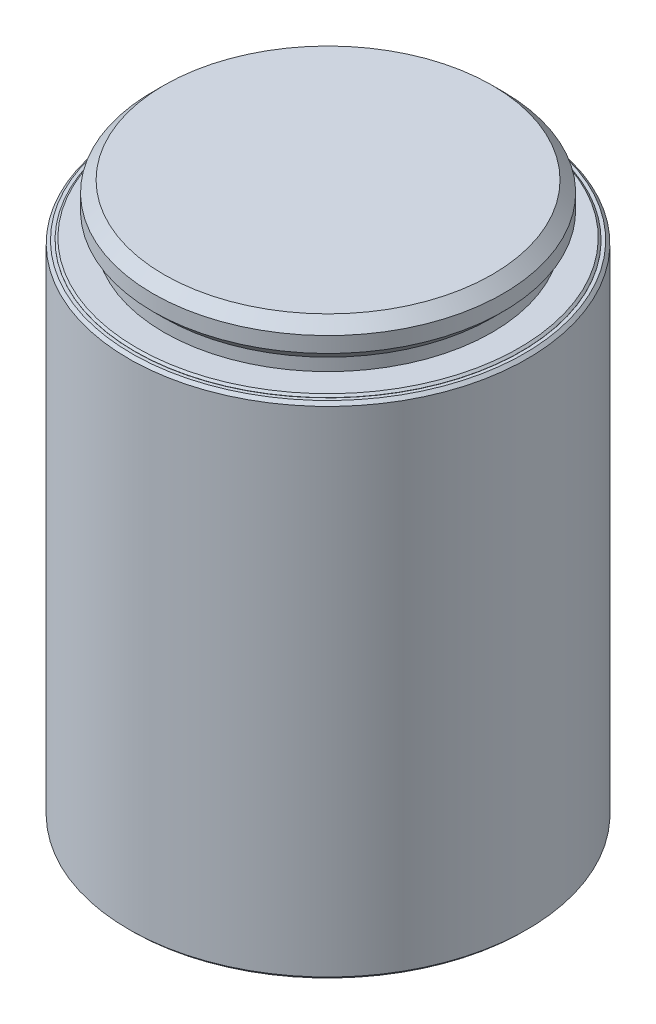
ISO-10303-21;
HEADER;
FILE_DESCRIPTION(('STEP AP214'),'2;1');
FILE_NAME('part.step','',(''),(''),'','','');
FILE_SCHEMA(('AUTOMOTIVE_DESIGN { 1 0 10303 214 1 1 1 1 }'));
ENDSEC;
DATA;
#1=APPLICATION_CONTEXT('core data for automotive mechanical design processes');
#2=APPLICATION_PROTOCOL_DEFINITION('international standard','automotive_design',2000,#1);
#3=PRODUCT_CONTEXT('',#1,'mechanical');
#4=PRODUCT('Part','Part','',(#3));
#5=PRODUCT_RELATED_PRODUCT_CATEGORY('part','',(#4));
#6=PRODUCT_DEFINITION_FORMATION('','',#4);
#7=PRODUCT_DEFINITION_CONTEXT('part definition',#1,'design');
#8=PRODUCT_DEFINITION('design','',#6,#7);
#9=PRODUCT_DEFINITION_SHAPE('','',#8);
#10=(LENGTH_UNIT() NAMED_UNIT(*) SI_UNIT(.MILLI.,.METRE.));
#11=(NAMED_UNIT(*) PLANE_ANGLE_UNIT() SI_UNIT($,.RADIAN.));
#12=(NAMED_UNIT(*) SI_UNIT($,.STERADIAN.) SOLID_ANGLE_UNIT());
#13=UNCERTAINTY_MEASURE_WITH_UNIT(LENGTH_MEASURE(1.E-05),#10,'distance_accuracy_value','');
#14=(GEOMETRIC_REPRESENTATION_CONTEXT(3) GLOBAL_UNCERTAINTY_ASSIGNED_CONTEXT((#13)) GLOBAL_UNIT_ASSIGNED_CONTEXT((#10,
#11,#12)) REPRESENTATION_CONTEXT('',''));
#15=CARTESIAN_POINT('',(0.,0.,0.));
#16=DIRECTION('',(0.,0.,1.));
#17=DIRECTION('',(1.,0.,0.));
#18=AXIS2_PLACEMENT_3D('',#15,#16,#17);
#19=CARTESIAN_POINT('',(0.,127.5588,0.));
#20=DIRECTION('',(0.,1.,0.));
#21=DIRECTION('',(-0.369174641205294,0.,0.929360040184073));
#22=AXIS2_PLACEMENT_3D('',#19,#20,#21);
#23=PLANE('',#22);
#24=CARTESIAN_POINT('',(0.,127.5588,0.));
#25=DIRECTION('',(0.,1.,0.));
#26=DIRECTION('',(0.,0.,1.));
#27=AXIS2_PLACEMENT_3D('',#24,#25,#26);
#28=CIRCLE('',#27,49.022);
#29=CARTESIAN_POINT('',(0.,127.5588,49.022));
#30=VERTEX_POINT('',#29);
#31=EDGE_CURVE('E19',#30,#30,#28,.T.);
#32=ORIENTED_EDGE('',*,*,#31,.F.);
#33=EDGE_LOOP('',(#32));
#34=FACE_BOUND('',#33,.T.);
#35=CARTESIAN_POINT('',(0.,127.5588,0.));
#36=DIRECTION('',(0.,1.,0.));
#37=DIRECTION('',(-0.369174641205294,0.,0.929360040184073));
#38=AXIS2_PLACEMENT_3D('',#35,#36,#37);
#39=CIRCLE('',#38,49.8475);
#40=CARTESIAN_POINT('',(-18.4024329274809,127.5588,46.3262746030756));
#41=VERTEX_POINT('',#40);
#42=EDGE_CURVE('E59',#41,#41,#39,.T.);
#43=ORIENTED_EDGE('',*,*,#42,.T.);
#44=EDGE_LOOP('',(#43));
#45=FACE_BOUND('',#44,.T.);
#46=ADVANCED_FACE('F15',(#34,#45),#23,.T.);
#47=CARTESIAN_POINT('',(0.,0.558799999999998,0.));
#48=DIRECTION('',(0.,1.,0.));
#49=DIRECTION('',(-0.369174641205294,0.,0.929360040184073));
#50=AXIS2_PLACEMENT_3D('',#47,#48,#49);
#51=PLANE('',#50);
#52=CARTESIAN_POINT('',(0.,0.558799999999998,0.));
#53=DIRECTION('',(0.,1.,0.));
#54=DIRECTION('',(0.,0.,1.));
#55=AXIS2_PLACEMENT_3D('',#52,#53,#54);
#56=CIRCLE('',#55,49.022);
#57=CARTESIAN_POINT('',(0.,0.558799999999998,49.022));
#58=VERTEX_POINT('',#57);
#59=EDGE_CURVE('E55',#58,#58,#56,.F.);
#60=ORIENTED_EDGE('',*,*,#59,.F.);
#61=EDGE_LOOP('',(#60));
#62=FACE_BOUND('',#61,.T.);
#63=CARTESIAN_POINT('',(0.,0.558799999999998,0.));
#64=DIRECTION('',(0.,1.,0.));
#65=DIRECTION('',(-0.369174641205294,0.,0.929360040184073));
#66=AXIS2_PLACEMENT_3D('',#63,#64,#65);
#67=CIRCLE('',#66,49.8475);
#68=CARTESIAN_POINT('',(-18.4024329274809,0.558799999999998,46.3262746030756));
#69=VERTEX_POINT('',#68);
#70=EDGE_CURVE('E63',#69,#69,#67,.F.);
#71=ORIENTED_EDGE('',*,*,#70,.T.);
#72=EDGE_LOOP('',(#71));
#73=FACE_BOUND('',#72,.T.);
#74=ADVANCED_FACE('F106',(#62,#73),#51,.F.);
#75=CARTESIAN_POINT('',(0.,127.5588,0.));
#76=DIRECTION('',(0.,-1.,0.));
#77=DIRECTION('',(0.369174641205294,0.,-0.929360040184073));
#78=AXIS2_PLACEMENT_3D('',#75,#76,#77);
#79=CYLINDRICAL_SURFACE('',#78,50.6095);
#80=CARTESIAN_POINT('',(0.,1.32080000000001,0.));
#81=DIRECTION('',(0.,1.,0.));
#82=DIRECTION('',(-0.369174641205294,0.,0.929360040184073));
#83=AXIS2_PLACEMENT_3D('',#80,#81,#82);
#84=CIRCLE('',#83,50.6095);
#85=CARTESIAN_POINT('',(-18.6837440040793,1.32080000000001,47.0344469536958));
#86=VERTEX_POINT('',#85);
#87=EDGE_CURVE('E67',#86,#86,#84,.T.);
#88=ORIENTED_EDGE('',*,*,#87,.T.);
#89=EDGE_LOOP('',(#88));
#90=FACE_BOUND('',#89,.T.);
#91=CARTESIAN_POINT('',(0.,126.7968,0.));
#92=DIRECTION('',(0.,1.,0.));
#93=DIRECTION('',(-0.369174641205294,0.,0.929360040184073));
#94=AXIS2_PLACEMENT_3D('',#91,#92,#93);
#95=CIRCLE('',#94,50.6095);
#96=CARTESIAN_POINT('',(-18.6837440040793,126.7968,47.0344469536958));
#97=VERTEX_POINT('',#96);
#98=EDGE_CURVE('E71',#97,#97,#95,.F.);
#99=ORIENTED_EDGE('',*,*,#98,.T.);
#100=EDGE_LOOP('',(#99));
#101=FACE_BOUND('',#100,.T.);
#102=ADVANCED_FACE('F111',(#90,#101),#79,.T.);
#103=CARTESIAN_POINT('',(0.,1.32080000000001,0.));
#104=DIRECTION('',(0.,1.,0.));
#105=DIRECTION('',(-0.369174641205294,0.,0.929360040184073));
#106=AXIS2_PLACEMENT_3D('',#103,#104,#105);
#107=CONICAL_SURFACE('',#106,50.6095,0.785398163397457);
#108=ORIENTED_EDGE('',*,*,#70,.F.);
#109=EDGE_LOOP('',(#108));
#110=FACE_BOUND('',#109,.T.);
#111=ORIENTED_EDGE('',*,*,#87,.F.);
#112=EDGE_LOOP('',(#111));
#113=FACE_BOUND('',#112,.T.);
#114=ADVANCED_FACE('F119',(#110,#113),#107,.T.);
#115=CARTESIAN_POINT('',(0.,127.5588,0.));
#116=DIRECTION('',(0.,-1.,0.));
#117=DIRECTION('',(0.369174641205294,0.,-0.929360040184073));
#118=AXIS2_PLACEMENT_3D('',#115,#116,#117);
#119=CONICAL_SURFACE('',#118,49.8475,0.785398163397439);
#120=ORIENTED_EDGE('',*,*,#98,.F.);
#121=EDGE_LOOP('',(#120));
#122=FACE_BOUND('',#121,.T.);
#123=ORIENTED_EDGE('',*,*,#42,.F.);
#124=EDGE_LOOP('',(#123));
#125=FACE_BOUND('',#124,.T.);
#126=ADVANCED_FACE('F123',(#122,#125),#119,.T.);
#127=CARTESIAN_POINT('',(0.,0.,0.));
#128=DIRECTION('',(0.,-1.,0.));
#129=DIRECTION('',(0.,0.,-1.));
#130=AXIS2_PLACEMENT_3D('',#127,#128,#129);
#131=CYLINDRICAL_SURFACE('',#130,49.022);
#132=CARTESIAN_POINT('',(0.,0.508000000000029,0.));
#133=DIRECTION('',(0.,1.,0.));
#134=DIRECTION('',(0.,0.,1.));
#135=AXIS2_PLACEMENT_3D('',#132,#133,#134);
#136=CIRCLE('',#135,49.022);
#137=CARTESIAN_POINT('',(0.,0.508000000000029,49.022));
#138=VERTEX_POINT('',#137);
#139=EDGE_CURVE('E75',#138,#138,#136,.T.);
#140=ORIENTED_EDGE('',*,*,#139,.T.);
#141=EDGE_LOOP('',(#140));
#142=FACE_BOUND('',#141,.T.);
#143=ORIENTED_EDGE('',*,*,#59,.T.);
#144=EDGE_LOOP('',(#143));
#145=FACE_BOUND('',#144,.T.);
#146=ADVANCED_FACE('F100',(#142,#145),#131,.T.);
#147=CARTESIAN_POINT('',(-49.022,0.,0.));
#148=DIRECTION('',(0.,1.,0.));
#149=DIRECTION('',(0.,0.,1.));
#150=AXIS2_PLACEMENT_3D('',#147,#148,#149);
#151=PLANE('',#150);
#152=CARTESIAN_POINT('',(0.,0.,0.));
#153=DIRECTION('',(0.,1.,0.));
#154=DIRECTION('',(0.,0.,1.));
#155=AXIS2_PLACEMENT_3D('',#152,#153,#154);
#156=CIRCLE('',#155,48.514);
#157=CARTESIAN_POINT('',(0.,0.,48.514));
#158=VERTEX_POINT('',#157);
#159=EDGE_CURVE('E79',#158,#158,#156,.F.);
#160=ORIENTED_EDGE('',*,*,#159,.T.);
#161=EDGE_LOOP('',(#160));
#162=FACE_BOUND('',#161,.T.);
#163=ADVANCED_FACE('F87',(#162),#151,.F.);
#164=CARTESIAN_POINT('',(0.,0.,0.));
#165=DIRECTION('',(0.,1.,0.));
#166=DIRECTION('',(0.,0.,1.));
#167=AXIS2_PLACEMENT_3D('',#164,#165,#166);
#168=CONICAL_SURFACE('',#167,48.514,0.785398163397435);
#169=ORIENTED_EDGE('',*,*,#139,.F.);
#170=EDGE_LOOP('',(#169));
#171=FACE_BOUND('',#170,.T.);
#172=ORIENTED_EDGE('',*,*,#159,.F.);
#173=EDGE_LOOP('',(#172));
#174=FACE_BOUND('',#173,.T.);
#175=ADVANCED_FACE('F89',(#171,#174),#168,.T.);
#176=CARTESIAN_POINT('',(-44.45,140.8176,0.));
#177=DIRECTION('',(0.,-1.,0.));
#178=DIRECTION('',(0.,0.,-1.));
#179=AXIS2_PLACEMENT_3D('',#176,#177,#178);
#180=PLANE('',#179);
#181=CARTESIAN_POINT('',(0.,140.8176,0.));
#182=DIRECTION('',(0.,1.,0.));
#183=DIRECTION('',(0.,0.,1.));
#184=AXIS2_PLACEMENT_3D('',#181,#182,#183);
#185=CIRCLE('',#184,41.656);
#186=CARTESIAN_POINT('',(0.,140.8176,41.656));
#187=VERTEX_POINT('',#186);
#188=EDGE_CURVE('E34',#187,#187,#185,.T.);
#189=ORIENTED_EDGE('',*,*,#188,.T.);
#190=EDGE_LOOP('',(#189));
#191=FACE_BOUND('',#190,.T.);
#192=ADVANCED_FACE('F91',(#191),#180,.F.);
#193=CARTESIAN_POINT('',(0.,140.8176,0.));
#194=DIRECTION('',(0.,1.,0.));
#195=DIRECTION('',(0.,0.,1.));
#196=AXIS2_PLACEMENT_3D('',#193,#194,#195);
#197=CYLINDRICAL_SURFACE('',#196,49.022);
#198=ORIENTED_EDGE('',*,*,#31,.T.);
#199=EDGE_LOOP('',(#198));
#200=FACE_BOUND('',#199,.T.);
#201=CARTESIAN_POINT('',(0.,127.6096,0.));
#202=DIRECTION('',(0.,-1.,0.));
#203=DIRECTION('',(0.,0.,-1.));
#204=AXIS2_PLACEMENT_3D('',#201,#202,#203);
#205=CIRCLE('',#204,49.022);
#206=CARTESIAN_POINT('',(0.,127.6096,-49.022));
#207=VERTEX_POINT('',#206);
#208=EDGE_CURVE('E24',#207,#207,#205,.T.);
#209=ORIENTED_EDGE('',*,*,#208,.T.);
#210=EDGE_LOOP('',(#209));
#211=FACE_BOUND('',#210,.T.);
#212=ADVANCED_FACE('F97',(#200,#211),#197,.T.);
#213=CARTESIAN_POINT('',(-49.022,128.1176,0.));
#214=DIRECTION('',(0.,-1.,0.));
#215=DIRECTION('',(0.,0.,-1.));
#216=AXIS2_PLACEMENT_3D('',#213,#214,#215);
#217=PLANE('',#216);
#218=CARTESIAN_POINT('',(0.,128.1176,0.));
#219=DIRECTION('',(0.,-1.,0.));
#220=DIRECTION('',(0.,0.,-1.));
#221=AXIS2_PLACEMENT_3D('',#218,#219,#220);
#222=CIRCLE('',#221,48.5140000000001);
#223=CARTESIAN_POINT('',(0.,128.1176,-48.5140000000001));
#224=VERTEX_POINT('',#223);
#225=EDGE_CURVE('E9',#224,#224,#222,.F.);
#226=ORIENTED_EDGE('',*,*,#225,.T.);
#227=EDGE_LOOP('',(#226));
#228=FACE_BOUND('',#227,.T.);
#229=CARTESIAN_POINT('',(0.,128.1176,0.));
#230=DIRECTION('',(0.,1.,0.));
#231=DIRECTION('',(0.,0.,1.));
#232=AXIS2_PLACEMENT_3D('',#229,#230,#231);
#233=CIRCLE('',#232,41.656);
#234=CARTESIAN_POINT('',(0.,128.1176,41.656));
#235=VERTEX_POINT('',#234);
#236=EDGE_CURVE('E37',#235,#235,#233,.T.);
#237=ORIENTED_EDGE('',*,*,#236,.F.);
#238=EDGE_LOOP('',(#237));
#239=FACE_BOUND('',#238,.T.);
#240=ADVANCED_FACE('F139',(#228,#239),#217,.F.);
#241=CARTESIAN_POINT('',(0.,140.8176,0.));
#242=DIRECTION('',(0.,1.,0.));
#243=DIRECTION('',(0.,0.,1.));
#244=AXIS2_PLACEMENT_3D('',#241,#242,#243);
#245=CYLINDRICAL_SURFACE('',#244,41.656);
#246=ORIENTED_EDGE('',*,*,#236,.T.);
#247=EDGE_LOOP('',(#246));
#248=FACE_BOUND('',#247,.T.);
#249=CARTESIAN_POINT('',(0.,131.2926,0.));
#250=DIRECTION('',(0.,1.,0.));
#251=DIRECTION('',(0.,0.,1.));
#252=AXIS2_PLACEMENT_3D('',#249,#250,#251);
#253=CIRCLE('',#252,41.656);
#254=CARTESIAN_POINT('',(0.,131.2926,41.656));
#255=VERTEX_POINT('',#254);
#256=EDGE_CURVE('E42',#255,#255,#253,.T.);
#257=ORIENTED_EDGE('',*,*,#256,.F.);
#258=EDGE_LOOP('',(#257));
#259=FACE_BOUND('',#258,.T.);
#260=ADVANCED_FACE('F135',(#248,#259),#245,.T.);
#261=CARTESIAN_POINT('',(0.,134.0866,0.));
#262=DIRECTION('',(0.,1.,0.));
#263=DIRECTION('',(0.,0.,1.));
#264=AXIS2_PLACEMENT_3D('',#261,#262,#263);
#265=CONICAL_SURFACE('',#264,44.45,0.78539816339745);
#266=ORIENTED_EDGE('',*,*,#256,.T.);
#267=EDGE_LOOP('',(#266));
#268=FACE_BOUND('',#267,.T.);
#269=CARTESIAN_POINT('',(0.,134.0866,0.));
#270=DIRECTION('',(0.,1.,0.));
#271=DIRECTION('',(0.,0.,1.));
#272=AXIS2_PLACEMENT_3D('',#269,#270,#271);
#273=CIRCLE('',#272,44.45);
#274=CARTESIAN_POINT('',(0.,134.0866,44.45));
#275=VERTEX_POINT('',#274);
#276=EDGE_CURVE('E46',#275,#275,#273,.T.);
#277=ORIENTED_EDGE('',*,*,#276,.F.);
#278=EDGE_LOOP('',(#277));
#279=FACE_BOUND('',#278,.T.);
#280=ADVANCED_FACE('F132',(#268,#279),#265,.T.);
#281=CARTESIAN_POINT('',(0.,140.8176,0.));
#282=DIRECTION('',(0.,-1.,0.));
#283=DIRECTION('',(0.,0.,-1.));
#284=AXIS2_PLACEMENT_3D('',#281,#282,#283);
#285=CONICAL_SURFACE('',#284,41.656,0.785398163397448);
#286=CARTESIAN_POINT('',(0.,138.0236,0.));
#287=DIRECTION('',(0.,1.,0.));
#288=DIRECTION('',(0.,0.,1.));
#289=AXIS2_PLACEMENT_3D('',#286,#287,#288);
#290=CIRCLE('',#289,44.45);
#291=CARTESIAN_POINT('',(0.,138.0236,44.45));
#292=VERTEX_POINT('',#291);
#293=EDGE_CURVE('E41',#292,#292,#290,.T.);
#294=ORIENTED_EDGE('',*,*,#293,.T.);
#295=EDGE_LOOP('',(#294));
#296=FACE_BOUND('',#295,.T.);
#297=ORIENTED_EDGE('',*,*,#188,.F.);
#298=EDGE_LOOP('',(#297));
#299=FACE_BOUND('',#298,.T.);
#300=ADVANCED_FACE('F128',(#296,#299),#285,.T.);
#301=CARTESIAN_POINT('',(0.,140.8176,0.));
#302=DIRECTION('',(0.,1.,0.));
#303=DIRECTION('',(0.,0.,1.));
#304=AXIS2_PLACEMENT_3D('',#301,#302,#303);
#305=CYLINDRICAL_SURFACE('',#304,44.45);
#306=ORIENTED_EDGE('',*,*,#276,.T.);
#307=EDGE_LOOP('',(#306));
#308=FACE_BOUND('',#307,.T.);
#309=ORIENTED_EDGE('',*,*,#293,.F.);
#310=EDGE_LOOP('',(#309));
#311=FACE_BOUND('',#310,.T.);
#312=ADVANCED_FACE('F131',(#308,#311),#305,.T.);
#313=CARTESIAN_POINT('',(0.,128.1176,0.));
#314=DIRECTION('',(0.,-1.,0.));
#315=DIRECTION('',(0.,0.,-1.));
#316=AXIS2_PLACEMENT_3D('',#313,#314,#315);
#317=CONICAL_SURFACE('',#316,48.5140000000001,0.785398163397435);
#318=ORIENTED_EDGE('',*,*,#208,.F.);
#319=EDGE_LOOP('',(#318));
#320=FACE_BOUND('',#319,.T.);
#321=ORIENTED_EDGE('',*,*,#225,.F.);
#322=EDGE_LOOP('',(#321));
#323=FACE_BOUND('',#322,.T.);
#324=ADVANCED_FACE('F17',(#320,#323),#317,.T.);
#325=CLOSED_SHELL('',(#46,#74,#102,#114,#126,#146,#163,#175,#192,#212,#240,#260,#280,#300,#312,#324));
#326=MANIFOLD_SOLID_BREP('B1',#325);
#327=ADVANCED_BREP_SHAPE_REPRESENTATION('',(#18,#326),#14);
#328=SHAPE_DEFINITION_REPRESENTATION(#9,#327);
ENDSEC;
END-ISO-10303-21;
